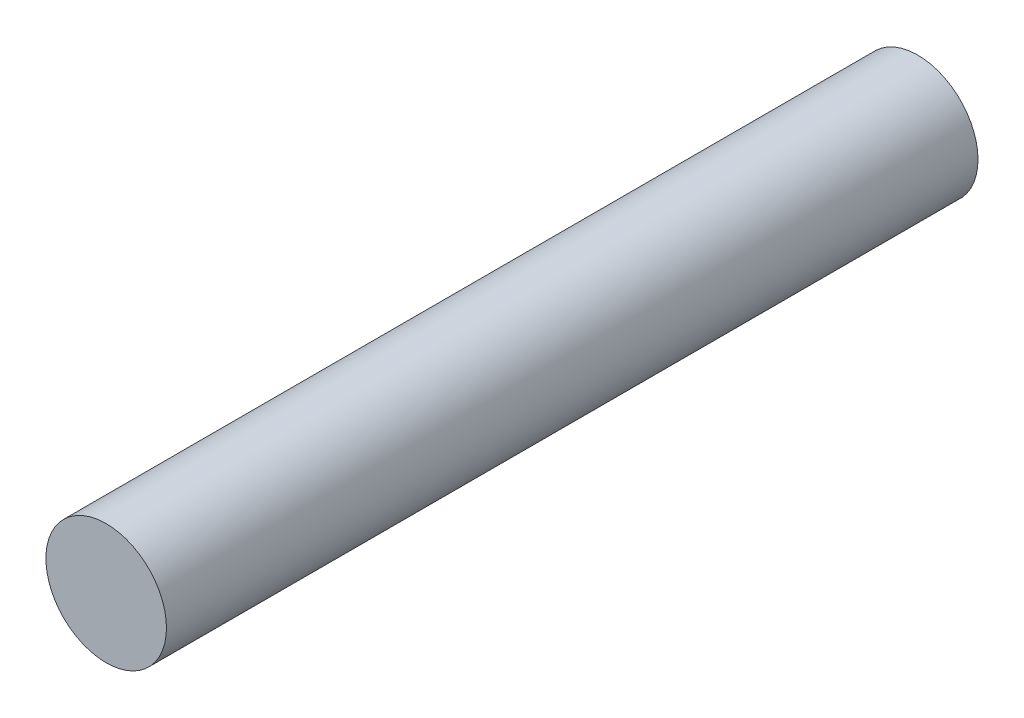
ISO-10303-21;
HEADER;
FILE_DESCRIPTION(('STEP AP214'),'2;1');
FILE_NAME('part.step','',(''),(''),'','','');
FILE_SCHEMA(('AUTOMOTIVE_DESIGN { 1 0 10303 214 1 1 1 1 }'));
ENDSEC;
DATA;
#1=APPLICATION_CONTEXT('core data for automotive mechanical design processes');
#2=APPLICATION_PROTOCOL_DEFINITION('international standard','automotive_design',2000,#1);
#3=PRODUCT_CONTEXT('',#1,'mechanical');
#4=PRODUCT('Part','Part','',(#3));
#5=PRODUCT_RELATED_PRODUCT_CATEGORY('part','',(#4));
#6=PRODUCT_DEFINITION_FORMATION('','',#4);
#7=PRODUCT_DEFINITION_CONTEXT('part definition',#1,'design');
#8=PRODUCT_DEFINITION('design','',#6,#7);
#9=PRODUCT_DEFINITION_SHAPE('','',#8);
#10=(LENGTH_UNIT() NAMED_UNIT(*) SI_UNIT(.MILLI.,.METRE.));
#11=(NAMED_UNIT(*) PLANE_ANGLE_UNIT() SI_UNIT($,.RADIAN.));
#12=(NAMED_UNIT(*) SI_UNIT($,.STERADIAN.) SOLID_ANGLE_UNIT());
#13=UNCERTAINTY_MEASURE_WITH_UNIT(LENGTH_MEASURE(1.E-05),#10,'distance_accuracy_value','');
#14=(GEOMETRIC_REPRESENTATION_CONTEXT(3) GLOBAL_UNCERTAINTY_ASSIGNED_CONTEXT((#13)) GLOBAL_UNIT_ASSIGNED_CONTEXT((#10,
#11,#12)) REPRESENTATION_CONTEXT('',''));
#15=CARTESIAN_POINT('',(0.,0.,0.));
#16=DIRECTION('',(0.,0.,1.));
#17=DIRECTION('',(1.,0.,0.));
#18=AXIS2_PLACEMENT_3D('',#15,#16,#17);
#19=CARTESIAN_POINT('',(0.,0.,44.45));
#20=DIRECTION('',(0.,0.,-1.));
#21=DIRECTION('',(-1.,0.,0.));
#22=AXIS2_PLACEMENT_3D('',#19,#20,#21);
#23=CYLINDRICAL_SURFACE('',#22,3.302);
#24=CARTESIAN_POINT('',(0.,0.,44.45));
#25=DIRECTION('',(0.,0.,1.));
#26=DIRECTION('',(1.,0.,0.));
#27=AXIS2_PLACEMENT_3D('',#24,#25,#26);
#28=CIRCLE('',#27,3.302);
#29=CARTESIAN_POINT('',(3.302,0.,44.45));
#30=VERTEX_POINT('',#29);
#31=EDGE_CURVE('E10',#30,#30,#28,.T.);
#32=ORIENTED_EDGE('',*,*,#31,.F.);
#33=EDGE_LOOP('',(#32));
#34=FACE_BOUND('',#33,.T.);
#35=CARTESIAN_POINT('',(0.,0.,0.));
#36=DIRECTION('',(0.,0.,1.));
#37=DIRECTION('',(1.,0.,0.));
#38=AXIS2_PLACEMENT_3D('',#35,#36,#37);
#39=CIRCLE('',#38,3.302);
#40=CARTESIAN_POINT('',(3.302,0.,0.));
#41=VERTEX_POINT('',#40);
#42=EDGE_CURVE('E33',#41,#41,#39,.T.);
#43=ORIENTED_EDGE('',*,*,#42,.T.);
#44=EDGE_LOOP('',(#43));
#45=FACE_BOUND('',#44,.T.);
#46=ADVANCED_FACE('F30',(#34,#45),#23,.T.);
#47=CARTESIAN_POINT('',(0.,0.,44.45));
#48=DIRECTION('',(0.,0.,1.));
#49=DIRECTION('',(1.,0.,0.));
#50=AXIS2_PLACEMENT_3D('',#47,#48,#49);
#51=PLANE('',#50);
#52=ORIENTED_EDGE('',*,*,#31,.T.);
#53=EDGE_LOOP('',(#52));
#54=FACE_BOUND('',#53,.T.);
#55=ADVANCED_FACE('F45',(#54),#51,.T.);
#56=CARTESIAN_POINT('',(0.,0.,0.));
#57=DIRECTION('',(0.,0.,1.));
#58=DIRECTION('',(1.,0.,0.));
#59=AXIS2_PLACEMENT_3D('',#56,#57,#58);
#60=PLANE('',#59);
#61=ORIENTED_EDGE('',*,*,#42,.F.);
#62=EDGE_LOOP('',(#61));
#63=FACE_BOUND('',#62,.T.);
#64=ADVANCED_FACE('F43',(#63),#60,.F.);
#65=CLOSED_SHELL('',(#46,#55,#64));
#66=MANIFOLD_SOLID_BREP('B2',#65);
#67=ADVANCED_BREP_SHAPE_REPRESENTATION('',(#18,#66),#14);
#68=SHAPE_DEFINITION_REPRESENTATION(#9,#67);
ENDSEC;
END-ISO-10303-21;
